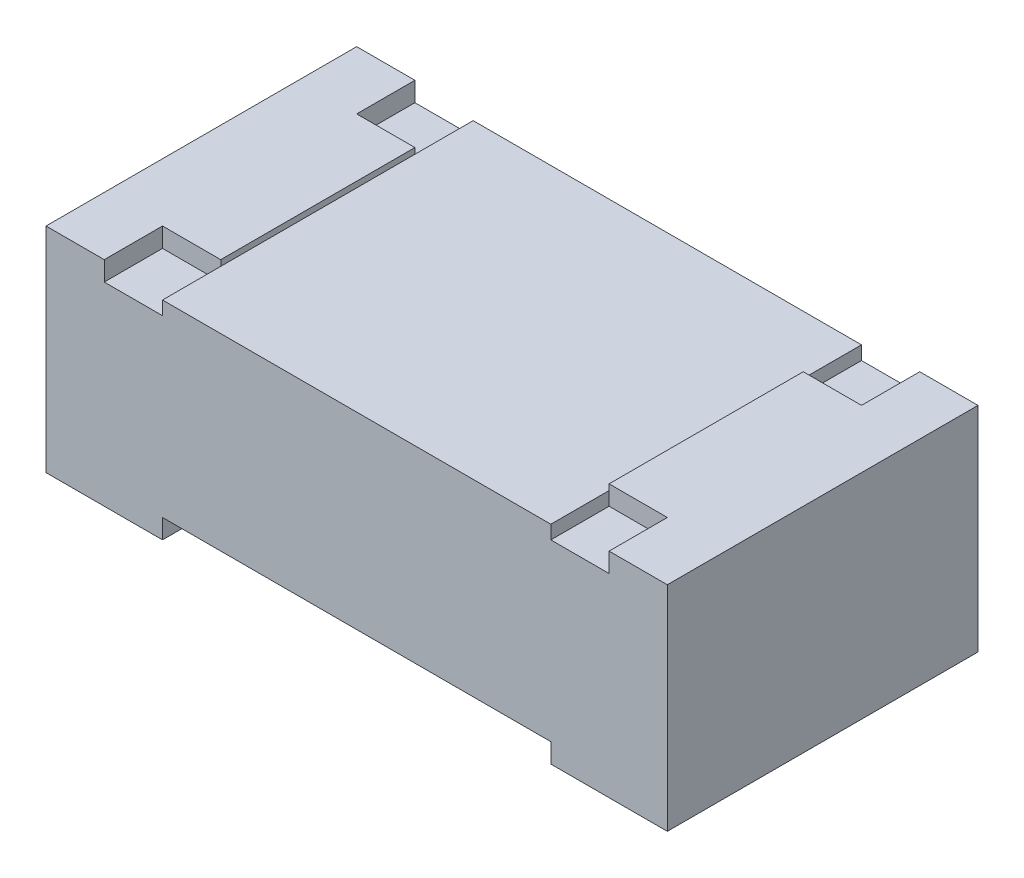
ISO-10303-21;
HEADER;
FILE_DESCRIPTION(('STEP AP214'),'2;1');
FILE_NAME('part.step','',(''),(''),'','','');
FILE_SCHEMA(('AUTOMOTIVE_DESIGN { 1 0 10303 214 1 1 1 1 }'));
ENDSEC;
DATA;
#1=APPLICATION_CONTEXT('core data for automotive mechanical design processes');
#2=APPLICATION_PROTOCOL_DEFINITION('international standard','automotive_design',2000,#1);
#3=PRODUCT_CONTEXT('',#1,'mechanical');
#4=PRODUCT('Part','Part','',(#3));
#5=PRODUCT_RELATED_PRODUCT_CATEGORY('part','',(#4));
#6=PRODUCT_DEFINITION_FORMATION('','',#4);
#7=PRODUCT_DEFINITION_CONTEXT('part definition',#1,'design');
#8=PRODUCT_DEFINITION('design','',#6,#7);
#9=PRODUCT_DEFINITION_SHAPE('','',#8);
#10=(LENGTH_UNIT() NAMED_UNIT(*) SI_UNIT(.MILLI.,.METRE.));
#11=(NAMED_UNIT(*) PLANE_ANGLE_UNIT() SI_UNIT($,.RADIAN.));
#12=(NAMED_UNIT(*) SI_UNIT($,.STERADIAN.) SOLID_ANGLE_UNIT());
#13=UNCERTAINTY_MEASURE_WITH_UNIT(LENGTH_MEASURE(1.E-05),#10,'distance_accuracy_value','');
#14=(GEOMETRIC_REPRESENTATION_CONTEXT(3) GLOBAL_UNCERTAINTY_ASSIGNED_CONTEXT((#13)) GLOBAL_UNIT_ASSIGNED_CONTEXT((#10,
#11,#12)) REPRESENTATION_CONTEXT('',''));
#15=CARTESIAN_POINT('',(0.,0.,0.));
#16=DIRECTION('',(0.,0.,1.));
#17=DIRECTION('',(1.,0.,0.));
#18=AXIS2_PLACEMENT_3D('',#15,#16,#17);
#19=CARTESIAN_POINT('',(12.8649999999998,1.58166,-40.4050019669691));
#20=DIRECTION('',(0.,-1.,0.));
#21=DIRECTION('',(1.,0.,0.));
#22=AXIS2_PLACEMENT_3D('',#19,#20,#21);
#23=PLANE('',#22);
#24=DIRECTION('',(0.,0.,1.));
#25=VECTOR('',#24,1.);
#26=CARTESIAN_POINT('',(12.5649999999998,1.58166,-40.4050019669691));
#27=LINE('',#26,#25);
#28=CARTESIAN_POINT('',(12.5649999999998,1.58166,-40.4050019669691));
#29=VERTEX_POINT('',#28);
#30=CARTESIAN_POINT('',(12.5649999999998,1.58166,-39.6050019669691));
#31=VERTEX_POINT('',#30);
#32=EDGE_CURVE('E19',#29,#31,#27,.T.);
#33=ORIENTED_EDGE('',*,*,#32,.F.);
#34=DIRECTION('',(-1.,0.,0.));
#35=VECTOR('',#34,1.);
#36=CARTESIAN_POINT('',(12.5649999999998,1.58166,-40.4050019669691));
#37=LINE('',#36,#35);
#38=CARTESIAN_POINT('',(12.8649999999998,1.58166,-40.4050019669691));
#39=VERTEX_POINT('',#38);
#40=EDGE_CURVE('E295',#39,#29,#37,.T.);
#41=ORIENTED_EDGE('',*,*,#40,.F.);
#42=DIRECTION('',(0.,0.,-1.));
#43=VECTOR('',#42,1.);
#44=CARTESIAN_POINT('',(12.8649999999998,1.58166,-40.4050019669691));
#45=LINE('',#44,#43);
#46=CARTESIAN_POINT('',(12.8649999999998,1.58166,-39.6050019669691));
#47=VERTEX_POINT('',#46);
#48=EDGE_CURVE('E305',#47,#39,#45,.T.);
#49=ORIENTED_EDGE('',*,*,#48,.F.);
#50=DIRECTION('',(-1.,0.,0.));
#51=VECTOR('',#50,1.);
#52=CARTESIAN_POINT('',(12.5649999999998,1.58166,-39.6050019669691));
#53=LINE('',#52,#51);
#54=EDGE_CURVE('E231',#47,#31,#53,.T.);
#55=ORIENTED_EDGE('',*,*,#54,.T.);
#56=EDGE_LOOP('',(#33,#41,#49,#55));
#57=FACE_BOUND('',#56,.T.);
#58=ADVANCED_FACE('F16',(#57),#23,.T.);
#59=CARTESIAN_POINT('',(12.5649999999998,1.58166,-40.4050019669691));
#60=DIRECTION('',(-1.,0.,0.));
#61=DIRECTION('',(0.,0.,1.));
#62=AXIS2_PLACEMENT_3D('',#59,#60,#61);
#63=PLANE('',#62);
#64=DIRECTION('',(0.,0.,1.));
#65=VECTOR('',#64,1.);
#66=CARTESIAN_POINT('',(12.5649999999998,1.63166,-40.4050019669691));
#67=LINE('',#66,#65);
#68=CARTESIAN_POINT('',(12.5649999999998,1.63166,-40.4050019669691));
#69=VERTEX_POINT('',#68);
#70=CARTESIAN_POINT('',(12.5649999999998,1.63166,-39.6050019669691));
#71=VERTEX_POINT('',#70);
#72=EDGE_CURVE('E247',#69,#71,#67,.T.);
#73=ORIENTED_EDGE('',*,*,#72,.F.);
#74=DIRECTION('',(0.,1.,0.));
#75=VECTOR('',#74,1.);
#76=CARTESIAN_POINT('',(12.5649999999998,1.58166,-40.4050019669691));
#77=LINE('',#76,#75);
#78=EDGE_CURVE('E226',#29,#69,#77,.T.);
#79=ORIENTED_EDGE('',*,*,#78,.F.);
#80=ORIENTED_EDGE('',*,*,#32,.T.);
#81=DIRECTION('',(0.,1.,0.));
#82=VECTOR('',#81,1.);
#83=CARTESIAN_POINT('',(12.5649999999998,1.58166,-39.6050019669691));
#84=LINE('',#83,#82);
#85=EDGE_CURVE('E223',#31,#71,#84,.T.);
#86=ORIENTED_EDGE('',*,*,#85,.T.);
#87=EDGE_LOOP('',(#73,#79,#80,#86));
#88=FACE_BOUND('',#87,.T.);
#89=ADVANCED_FACE('F222',(#88),#63,.T.);
#90=CARTESIAN_POINT('',(11.2649999999998,1.58166,-40.4050019669691));
#91=DIRECTION('',(0.,-1.,0.));
#92=DIRECTION('',(1.,0.,0.));
#93=AXIS2_PLACEMENT_3D('',#90,#91,#92);
#94=PLANE('',#93);
#95=DIRECTION('',(0.,0.,1.));
#96=VECTOR('',#95,1.);
#97=CARTESIAN_POINT('',(11.2649999999998,1.58166,-40.4050019669691));
#98=LINE('',#97,#96);
#99=CARTESIAN_POINT('',(11.2649999999998,1.58166,-40.4050019669691));
#100=VERTEX_POINT('',#99);
#101=CARTESIAN_POINT('',(11.2649999999998,1.58166,-39.6050019669691));
#102=VERTEX_POINT('',#101);
#103=EDGE_CURVE('E192',#100,#102,#98,.T.);
#104=ORIENTED_EDGE('',*,*,#103,.F.);
#105=DIRECTION('',(1.,0.,0.));
#106=VECTOR('',#105,1.);
#107=CARTESIAN_POINT('',(11.5649999999998,1.58166,-40.4050019669691));
#108=LINE('',#107,#106);
#109=CARTESIAN_POINT('',(11.5649999999998,1.58166,-40.4050019669691));
#110=VERTEX_POINT('',#109);
#111=EDGE_CURVE('E291',#100,#110,#108,.T.);
#112=ORIENTED_EDGE('',*,*,#111,.T.);
#113=DIRECTION('',(0.,0.,-1.));
#114=VECTOR('',#113,1.);
#115=CARTESIAN_POINT('',(11.5649999999998,1.58166,-40.4050019669691));
#116=LINE('',#115,#114);
#117=CARTESIAN_POINT('',(11.5649999999998,1.58166,-39.6050019669691));
#118=VERTEX_POINT('',#117);
#119=EDGE_CURVE('E187',#118,#110,#116,.T.);
#120=ORIENTED_EDGE('',*,*,#119,.F.);
#121=DIRECTION('',(1.,0.,0.));
#122=VECTOR('',#121,1.);
#123=CARTESIAN_POINT('',(11.5649999999998,1.58166,-39.6050019669691));
#124=LINE('',#123,#122);
#125=EDGE_CURVE('E203',#102,#118,#124,.T.);
#126=ORIENTED_EDGE('',*,*,#125,.F.);
#127=EDGE_LOOP('',(#104,#112,#120,#126));
#128=FACE_BOUND('',#127,.T.);
#129=ADVANCED_FACE('F204',(#128),#94,.T.);
#130=CARTESIAN_POINT('',(11.5649999999998,1.58166,-40.4050019669691));
#131=DIRECTION('',(1.,0.,0.));
#132=DIRECTION('',(0.,0.,-1.));
#133=AXIS2_PLACEMENT_3D('',#130,#131,#132);
#134=PLANE('',#133);
#135=ORIENTED_EDGE('',*,*,#119,.T.);
#136=DIRECTION('',(0.,1.,0.));
#137=VECTOR('',#136,1.);
#138=CARTESIAN_POINT('',(11.5649999999998,2.08166,-40.4050019669691));
#139=LINE('',#138,#137);
#140=CARTESIAN_POINT('',(11.5649999999998,1.63166,-40.4050019669691));
#141=VERTEX_POINT('',#140);
#142=EDGE_CURVE('E289',#110,#141,#139,.T.);
#143=ORIENTED_EDGE('',*,*,#142,.T.);
#144=DIRECTION('',(0.,0.,1.));
#145=VECTOR('',#144,1.);
#146=CARTESIAN_POINT('',(11.5649999999998,1.63166,-40.4050019669691));
#147=LINE('',#146,#145);
#148=CARTESIAN_POINT('',(11.5649999999998,1.63166,-39.6050019669691));
#149=VERTEX_POINT('',#148);
#150=EDGE_CURVE('E245',#149,#141,#147,.F.);
#151=ORIENTED_EDGE('',*,*,#150,.F.);
#152=DIRECTION('',(0.,1.,0.));
#153=VECTOR('',#152,1.);
#154=CARTESIAN_POINT('',(11.5649999999998,2.08166,-39.6050019669691));
#155=LINE('',#154,#153);
#156=EDGE_CURVE('E207',#118,#149,#155,.T.);
#157=ORIENTED_EDGE('',*,*,#156,.F.);
#158=EDGE_LOOP('',(#135,#143,#151,#157));
#159=FACE_BOUND('',#158,.T.);
#160=ADVANCED_FACE('F489',(#159),#134,.T.);
#161=CARTESIAN_POINT('',(11.4149999999998,2.08166,-40.4050019669691));
#162=DIRECTION('',(-1.,0.,0.));
#163=DIRECTION('',(0.,0.,1.));
#164=AXIS2_PLACEMENT_3D('',#161,#162,#163);
#165=PLANE('',#164);
#166=DIRECTION('',(0.,1.,0.));
#167=VECTOR('',#166,1.);
#168=CARTESIAN_POINT('',(11.4149999999998,2.08166,-40.2550019669691));
#169=LINE('',#168,#167);
#170=CARTESIAN_POINT('',(11.4149999999998,2.13166,-40.2550019669691));
#171=VERTEX_POINT('',#170);
#172=CARTESIAN_POINT('',(11.4149999999998,2.08166,-40.2550019669691));
#173=VERTEX_POINT('',#172);
#174=EDGE_CURVE('E282',#171,#173,#169,.F.);
#175=ORIENTED_EDGE('',*,*,#174,.T.);
#176=DIRECTION('',(0.,0.,1.));
#177=VECTOR('',#176,1.);
#178=CARTESIAN_POINT('',(11.4149999999998,2.08166,-40.4050019669691));
#179=LINE('',#178,#177);
#180=CARTESIAN_POINT('',(11.4149999999998,2.08166,-40.4050019669691));
#181=VERTEX_POINT('',#180);
#182=EDGE_CURVE('E284',#181,#173,#179,.T.);
#183=ORIENTED_EDGE('',*,*,#182,.F.);
#184=DIRECTION('',(0.,1.,0.));
#185=VECTOR('',#184,1.);
#186=CARTESIAN_POINT('',(11.4149999999998,2.08166,-40.4050019669691));
#187=LINE('',#186,#185);
#188=CARTESIAN_POINT('',(11.4149999999998,2.13166,-40.4050019669691));
#189=VERTEX_POINT('',#188);
#190=EDGE_CURVE('E287',#181,#189,#187,.T.);
#191=ORIENTED_EDGE('',*,*,#190,.T.);
#192=DIRECTION('',(0.,0.,1.));
#193=VECTOR('',#192,1.);
#194=CARTESIAN_POINT('',(11.4149999999998,2.13166,-40.4050019669691));
#195=LINE('',#194,#193);
#196=EDGE_CURVE('E274',#171,#189,#195,.F.);
#197=ORIENTED_EDGE('',*,*,#196,.F.);
#198=EDGE_LOOP('',(#175,#183,#191,#197));
#199=FACE_BOUND('',#198,.T.);
#200=ADVANCED_FACE('F491',(#199),#165,.F.);
#201=CARTESIAN_POINT('',(11.2649999999998,2.13166,-40.4050019669691));
#202=DIRECTION('',(-1.,0.,0.));
#203=DIRECTION('',(0.,0.,1.));
#204=AXIS2_PLACEMENT_3D('',#201,#202,#203);
#205=PLANE('',#204);
#206=DIRECTION('',(0.,0.,1.));
#207=VECTOR('',#206,1.);
#208=CARTESIAN_POINT('',(11.2649999999998,2.13166,-40.4050019669691));
#209=LINE('',#208,#207);
#210=CARTESIAN_POINT('',(11.2649999999998,2.13166,-40.4050019669691));
#211=VERTEX_POINT('',#210);
#212=CARTESIAN_POINT('',(11.2649999999998,2.13166,-39.6050019669691));
#213=VERTEX_POINT('',#212);
#214=EDGE_CURVE('E269',#211,#213,#209,.T.);
#215=ORIENTED_EDGE('',*,*,#214,.F.);
#216=DIRECTION('',(0.,1.,0.));
#217=VECTOR('',#216,1.);
#218=CARTESIAN_POINT('',(11.2649999999998,2.08166,-40.4050019669691));
#219=LINE('',#218,#217);
#220=EDGE_CURVE('E198',#211,#100,#219,.F.);
#221=ORIENTED_EDGE('',*,*,#220,.T.);
#222=ORIENTED_EDGE('',*,*,#103,.T.);
#223=DIRECTION('',(0.,1.,0.));
#224=VECTOR('',#223,1.);
#225=CARTESIAN_POINT('',(11.2649999999998,2.08166,-39.6050019669691));
#226=LINE('',#225,#224);
#227=EDGE_CURVE('E196',#213,#102,#226,.F.);
#228=ORIENTED_EDGE('',*,*,#227,.F.);
#229=EDGE_LOOP('',(#215,#221,#222,#228));
#230=FACE_BOUND('',#229,.T.);
#231=ADVANCED_FACE('F194',(#230),#205,.T.);
#232=CARTESIAN_POINT('',(11.4149999999998,2.08166,-39.6050019669691));
#233=DIRECTION('',(-1.,0.,0.));
#234=DIRECTION('',(0.,0.,1.));
#235=AXIS2_PLACEMENT_3D('',#232,#233,#234);
#236=PLANE('',#235);
#237=DIRECTION('',(0.,1.,0.));
#238=VECTOR('',#237,1.);
#239=CARTESIAN_POINT('',(11.4149999999998,2.08166,-39.6050019669691));
#240=LINE('',#239,#238);
#241=CARTESIAN_POINT('',(11.4149999999998,2.08166,-39.6050019669691));
#242=VERTEX_POINT('',#241);
#243=CARTESIAN_POINT('',(11.4149999999998,2.13166,-39.6050019669691));
#244=VERTEX_POINT('',#243);
#245=EDGE_CURVE('E200',#242,#244,#240,.T.);
#246=ORIENTED_EDGE('',*,*,#245,.F.);
#247=DIRECTION('',(0.,0.,1.));
#248=VECTOR('',#247,1.);
#249=CARTESIAN_POINT('',(11.4149999999998,2.08166,-40.4050019669691));
#250=LINE('',#249,#248);
#251=CARTESIAN_POINT('',(11.4149999999998,2.08166,-39.7550019669691));
#252=VERTEX_POINT('',#251);
#253=EDGE_CURVE('E249',#252,#242,#250,.T.);
#254=ORIENTED_EDGE('',*,*,#253,.F.);
#255=DIRECTION('',(0.,1.,0.));
#256=VECTOR('',#255,1.);
#257=CARTESIAN_POINT('',(11.4149999999998,2.08166,-39.7550019669691));
#258=LINE('',#257,#256);
#259=CARTESIAN_POINT('',(11.4149999999998,2.13166,-39.7550019669691));
#260=VERTEX_POINT('',#259);
#261=EDGE_CURVE('E263',#252,#260,#258,.T.);
#262=ORIENTED_EDGE('',*,*,#261,.T.);
#263=DIRECTION('',(0.,0.,1.));
#264=VECTOR('',#263,1.);
#265=CARTESIAN_POINT('',(11.4149999999998,2.13166,-40.4050019669691));
#266=LINE('',#265,#264);
#267=EDGE_CURVE('E265',#244,#260,#266,.F.);
#268=ORIENTED_EDGE('',*,*,#267,.F.);
#269=EDGE_LOOP('',(#246,#254,#262,#268));
#270=FACE_BOUND('',#269,.T.);
#271=ADVANCED_FACE('F483',(#270),#236,.F.);
#272=CARTESIAN_POINT('',(12.7149999999998,2.08166,-39.6050019669691));
#273=DIRECTION('',(1.,0.,0.));
#274=DIRECTION('',(0.,0.,-1.));
#275=AXIS2_PLACEMENT_3D('',#272,#273,#274);
#276=PLANE('',#275);
#277=DIRECTION('',(0.,1.,0.));
#278=VECTOR('',#277,1.);
#279=CARTESIAN_POINT('',(12.7149999999998,2.08166,-39.7550019669691));
#280=LINE('',#279,#278);
#281=CARTESIAN_POINT('',(12.7149999999998,2.13166,-39.7550019669691));
#282=VERTEX_POINT('',#281);
#283=CARTESIAN_POINT('',(12.7149999999998,2.08166,-39.7550019669691));
#284=VERTEX_POINT('',#283);
#285=EDGE_CURVE('E335',#282,#284,#280,.F.);
#286=ORIENTED_EDGE('',*,*,#285,.T.);
#287=DIRECTION('',(0.,0.,1.));
#288=VECTOR('',#287,1.);
#289=CARTESIAN_POINT('',(12.7149999999998,2.08166,-40.4050019669691));
#290=LINE('',#289,#288);
#291=CARTESIAN_POINT('',(12.7149999999998,2.08166,-39.6050019669691));
#292=VERTEX_POINT('',#291);
#293=EDGE_CURVE('E252',#292,#284,#290,.F.);
#294=ORIENTED_EDGE('',*,*,#293,.F.);
#295=DIRECTION('',(0.,1.,0.));
#296=VECTOR('',#295,1.);
#297=CARTESIAN_POINT('',(12.7149999999998,1.58166,-39.6050019669691));
#298=LINE('',#297,#296);
#299=CARTESIAN_POINT('',(12.7149999999998,2.13166,-39.6050019669691));
#300=VERTEX_POINT('',#299);
#301=EDGE_CURVE('E235',#292,#300,#298,.T.);
#302=ORIENTED_EDGE('',*,*,#301,.T.);
#303=DIRECTION('',(0.,0.,1.));
#304=VECTOR('',#303,1.);
#305=CARTESIAN_POINT('',(12.7149999999998,2.13166,-40.4050019669691));
#306=LINE('',#305,#304);
#307=EDGE_CURVE('E318',#282,#300,#306,.T.);
#308=ORIENTED_EDGE('',*,*,#307,.F.);
#309=EDGE_LOOP('',(#286,#294,#302,#308));
#310=FACE_BOUND('',#309,.T.);
#311=ADVANCED_FACE('F553',(#310),#276,.F.);
#312=CARTESIAN_POINT('',(12.8649999999998,2.13166,-40.4050019669691));
#313=DIRECTION('',(1.,0.,0.));
#314=DIRECTION('',(0.,0.,-1.));
#315=AXIS2_PLACEMENT_3D('',#312,#313,#314);
#316=PLANE('',#315);
#317=ORIENTED_EDGE('',*,*,#48,.T.);
#318=DIRECTION('',(0.,1.,0.));
#319=VECTOR('',#318,1.);
#320=CARTESIAN_POINT('',(12.8649999999998,1.58166,-40.4050019669691));
#321=LINE('',#320,#319);
#322=CARTESIAN_POINT('',(12.8649999999998,2.13166,-40.4050019669691));
#323=VERTEX_POINT('',#322);
#324=EDGE_CURVE('E297',#323,#39,#321,.F.);
#325=ORIENTED_EDGE('',*,*,#324,.F.);
#326=DIRECTION('',(0.,0.,1.));
#327=VECTOR('',#326,1.);
#328=CARTESIAN_POINT('',(12.8649999999998,2.13166,-40.4050019669691));
#329=LINE('',#328,#327);
#330=CARTESIAN_POINT('',(12.8649999999998,2.13166,-39.6050019669691));
#331=VERTEX_POINT('',#330);
#332=EDGE_CURVE('E311',#331,#323,#329,.F.);
#333=ORIENTED_EDGE('',*,*,#332,.F.);
#334=DIRECTION('',(0.,1.,0.));
#335=VECTOR('',#334,1.);
#336=CARTESIAN_POINT('',(12.8649999999998,2.13166,-39.6050019669691));
#337=LINE('',#336,#335);
#338=EDGE_CURVE('E237',#331,#47,#337,.F.);
#339=ORIENTED_EDGE('',*,*,#338,.T.);
#340=EDGE_LOOP('',(#317,#325,#333,#339));
#341=FACE_BOUND('',#340,.T.);
#342=ADVANCED_FACE('F309',(#341),#316,.T.);
#343=CARTESIAN_POINT('',(12.7149999999998,2.08166,-40.4050019669691));
#344=DIRECTION('',(1.,0.,0.));
#345=DIRECTION('',(0.,0.,-1.));
#346=AXIS2_PLACEMENT_3D('',#343,#344,#345);
#347=PLANE('',#346);
#348=DIRECTION('',(0.,1.,0.));
#349=VECTOR('',#348,1.);
#350=CARTESIAN_POINT('',(12.7149999999998,1.58166,-40.4050019669691));
#351=LINE('',#350,#349);
#352=CARTESIAN_POINT('',(12.7149999999998,2.08166,-40.4050019669691));
#353=VERTEX_POINT('',#352);
#354=CARTESIAN_POINT('',(12.7149999999998,2.13166,-40.4050019669691));
#355=VERTEX_POINT('',#354);
#356=EDGE_CURVE('E300',#353,#355,#351,.T.);
#357=ORIENTED_EDGE('',*,*,#356,.F.);
#358=DIRECTION('',(0.,0.,1.));
#359=VECTOR('',#358,1.);
#360=CARTESIAN_POINT('',(12.7149999999998,2.08166,-40.4050019669691));
#361=LINE('',#360,#359);
#362=CARTESIAN_POINT('',(12.7149999999998,2.08166,-40.2550019669691));
#363=VERTEX_POINT('',#362);
#364=EDGE_CURVE('E400',#363,#353,#361,.F.);
#365=ORIENTED_EDGE('',*,*,#364,.F.);
#366=DIRECTION('',(0.,1.,0.));
#367=VECTOR('',#366,1.);
#368=CARTESIAN_POINT('',(12.7149999999998,2.08166,-40.2550019669691));
#369=LINE('',#368,#367);
#370=CARTESIAN_POINT('',(12.7149999999998,2.13166,-40.2550019669691));
#371=VERTEX_POINT('',#370);
#372=EDGE_CURVE('E405',#363,#371,#369,.T.);
#373=ORIENTED_EDGE('',*,*,#372,.T.);
#374=DIRECTION('',(0.,0.,1.));
#375=VECTOR('',#374,1.);
#376=CARTESIAN_POINT('',(12.7149999999998,2.13166,-40.4050019669691));
#377=LINE('',#376,#375);
#378=EDGE_CURVE('E327',#355,#371,#377,.T.);
#379=ORIENTED_EDGE('',*,*,#378,.F.);
#380=EDGE_LOOP('',(#357,#365,#373,#379));
#381=FACE_BOUND('',#380,.T.);
#382=ADVANCED_FACE('F415',(#381),#347,.F.);
#383=CARTESIAN_POINT('',(11.3149999999998,1.63166,-40.4050019669691));
#384=DIRECTION('',(0.,-1.,0.));
#385=DIRECTION('',(1.,0.,0.));
#386=AXIS2_PLACEMENT_3D('',#383,#384,#385);
#387=PLANE('',#386);
#388=ORIENTED_EDGE('',*,*,#150,.T.);
#389=DIRECTION('',(1.,0.,0.));
#390=VECTOR('',#389,1.);
#391=CARTESIAN_POINT('',(11.3149999999998,1.63166,-40.4050019669691));
#392=LINE('',#391,#390);
#393=EDGE_CURVE('E395',#141,#69,#392,.T.);
#394=ORIENTED_EDGE('',*,*,#393,.T.);
#395=ORIENTED_EDGE('',*,*,#72,.T.);
#396=DIRECTION('',(1.,0.,0.));
#397=VECTOR('',#396,1.);
#398=CARTESIAN_POINT('',(11.3149999999998,1.63166,-39.6050019669691));
#399=LINE('',#398,#397);
#400=EDGE_CURVE('E234',#149,#71,#399,.T.);
#401=ORIENTED_EDGE('',*,*,#400,.F.);
#402=EDGE_LOOP('',(#388,#394,#395,#401));
#403=FACE_BOUND('',#402,.T.);
#404=ADVANCED_FACE('F243',(#403),#387,.T.);
#405=CARTESIAN_POINT('',(11.3149999999998,2.08166,-40.4050019669691));
#406=DIRECTION('',(0.,1.,0.));
#407=DIRECTION('',(-1.,0.,0.));
#408=AXIS2_PLACEMENT_3D('',#405,#406,#407);
#409=PLANE('',#408);
#410=DIRECTION('',(1.,0.,0.));
#411=VECTOR('',#410,1.);
#412=CARTESIAN_POINT('',(11.3149999999998,2.08166,-40.4050019669691));
#413=LINE('',#412,#411);
#414=CARTESIAN_POINT('',(11.5649999999998,2.08166,-40.4050019669691));
#415=VERTEX_POINT('',#414);
#416=EDGE_CURVE('E390',#415,#181,#413,.F.);
#417=ORIENTED_EDGE('',*,*,#416,.T.);
#418=ORIENTED_EDGE('',*,*,#182,.T.);
#419=DIRECTION('',(1.,0.,0.));
#420=VECTOR('',#419,1.);
#421=CARTESIAN_POINT('',(11.4149999999998,2.08166,-40.2550019669691));
#422=LINE('',#421,#420);
#423=CARTESIAN_POINT('',(11.5649999999998,2.08166,-40.2550019669691));
#424=VERTEX_POINT('',#423);
#425=EDGE_CURVE('E280',#173,#424,#422,.T.);
#426=ORIENTED_EDGE('',*,*,#425,.T.);
#427=DIRECTION('',(0.,0.,1.));
#428=VECTOR('',#427,1.);
#429=CARTESIAN_POINT('',(11.5649999999998,2.08166,-40.4050019669691));
#430=LINE('',#429,#428);
#431=EDGE_CURVE('E384',#415,#424,#430,.T.);
#432=ORIENTED_EDGE('',*,*,#431,.F.);
#433=EDGE_LOOP('',(#417,#418,#426,#432));
#434=FACE_BOUND('',#433,.T.);
#435=ADVANCED_FACE('F543',(#434),#409,.T.);
#436=CARTESIAN_POINT('',(11.4149999999998,2.08166,-40.2550019669691));
#437=DIRECTION('',(0.,0.,1.));
#438=DIRECTION('',(1.,0.,0.));
#439=AXIS2_PLACEMENT_3D('',#436,#437,#438);
#440=PLANE('',#439);
#441=DIRECTION('',(0.,1.,0.));
#442=VECTOR('',#441,1.);
#443=CARTESIAN_POINT('',(11.5649999999998,2.11666,-40.2550019669691));
#444=LINE('',#443,#442);
#445=CARTESIAN_POINT('',(11.5649999999998,2.11666,-40.2550019669691));
#446=VERTEX_POINT('',#445);
#447=EDGE_CURVE('E387',#424,#446,#444,.T.);
#448=ORIENTED_EDGE('',*,*,#447,.F.);
#449=ORIENTED_EDGE('',*,*,#425,.F.);
#450=ORIENTED_EDGE('',*,*,#174,.F.);
#451=DIRECTION('',(-1.,0.,0.));
#452=VECTOR('',#451,1.);
#453=CARTESIAN_POINT('',(11.5649999999998,2.13166,-40.2550019669691));
#454=LINE('',#453,#452);
#455=CARTESIAN_POINT('',(11.5649999999998,2.13166,-40.2550019669691));
#456=VERTEX_POINT('',#455);
#457=EDGE_CURVE('E277',#456,#171,#454,.T.);
#458=ORIENTED_EDGE('',*,*,#457,.F.);
#459=DIRECTION('',(0.,1.,0.));
#460=VECTOR('',#459,1.);
#461=CARTESIAN_POINT('',(11.5649999999998,2.13166,-40.2550019669691));
#462=LINE('',#461,#460);
#463=EDGE_CURVE('E381',#446,#456,#462,.T.);
#464=ORIENTED_EDGE('',*,*,#463,.F.);
#465=EDGE_LOOP('',(#448,#449,#450,#458,#464));
#466=FACE_BOUND('',#465,.T.);
#467=ADVANCED_FACE('F540',(#466),#440,.F.);
#468=CARTESIAN_POINT('',(11.5649999999998,2.13166,-40.4050019669691));
#469=DIRECTION('',(0.,1.,0.));
#470=DIRECTION('',(-1.,0.,0.));
#471=AXIS2_PLACEMENT_3D('',#468,#469,#470);
#472=PLANE('',#471);
#473=DIRECTION('',(-1.,0.,0.));
#474=VECTOR('',#473,1.);
#475=CARTESIAN_POINT('',(11.4149999999998,2.13166,-39.7550019669691));
#476=LINE('',#475,#474);
#477=CARTESIAN_POINT('',(11.5649999999998,2.13166,-39.7550019669691));
#478=VERTEX_POINT('',#477);
#479=EDGE_CURVE('E261',#260,#478,#476,.F.);
#480=ORIENTED_EDGE('',*,*,#479,.T.);
#481=DIRECTION('',(0.,0.,-1.));
#482=VECTOR('',#481,1.);
#483=CARTESIAN_POINT('',(11.5649999999998,2.13166,-40.4050019669691));
#484=LINE('',#483,#482);
#485=EDGE_CURVE('E378',#456,#478,#484,.F.);
#486=ORIENTED_EDGE('',*,*,#485,.F.);
#487=ORIENTED_EDGE('',*,*,#457,.T.);
#488=ORIENTED_EDGE('',*,*,#196,.T.);
#489=DIRECTION('',(-1.,0.,0.));
#490=VECTOR('',#489,1.);
#491=CARTESIAN_POINT('',(11.5649999999998,2.13166,-40.4050019669691));
#492=LINE('',#491,#490);
#493=EDGE_CURVE('E271',#189,#211,#492,.T.);
#494=ORIENTED_EDGE('',*,*,#493,.T.);
#495=ORIENTED_EDGE('',*,*,#214,.T.);
#496=DIRECTION('',(-1.,0.,0.));
#497=VECTOR('',#496,1.);
#498=CARTESIAN_POINT('',(11.5649999999998,2.13166,-39.6050019669691));
#499=LINE('',#498,#497);
#500=EDGE_CURVE('E211',#213,#244,#499,.F.);
#501=ORIENTED_EDGE('',*,*,#500,.T.);
#502=ORIENTED_EDGE('',*,*,#267,.T.);
#503=EDGE_LOOP('',(#480,#486,#487,#488,#494,#495,#501,#502));
#504=FACE_BOUND('',#503,.T.);
#505=ADVANCED_FACE('F486',(#504),#472,.T.);
#506=CARTESIAN_POINT('',(11.4149999999998,2.08166,-39.7550019669691));
#507=DIRECTION('',(0.,0.,-1.));
#508=DIRECTION('',(-1.,0.,0.));
#509=AXIS2_PLACEMENT_3D('',#506,#507,#508);
#510=PLANE('',#509);
#511=DIRECTION('',(0.,1.,0.));
#512=VECTOR('',#511,1.);
#513=CARTESIAN_POINT('',(11.5649999999998,2.13166,-39.7550019669691));
#514=LINE('',#513,#512);
#515=CARTESIAN_POINT('',(11.5649999999998,2.11666,-39.7550019669691));
#516=VERTEX_POINT('',#515);
#517=EDGE_CURVE('E375',#478,#516,#514,.F.);
#518=ORIENTED_EDGE('',*,*,#517,.F.);
#519=ORIENTED_EDGE('',*,*,#479,.F.);
#520=ORIENTED_EDGE('',*,*,#261,.F.);
#521=DIRECTION('',(-1.,0.,0.));
#522=VECTOR('',#521,1.);
#523=CARTESIAN_POINT('',(11.3149999999998,2.08166,-39.7550019669691));
#524=LINE('',#523,#522);
#525=CARTESIAN_POINT('',(11.5649999999998,2.08166,-39.7550019669691));
#526=VERTEX_POINT('',#525);
#527=EDGE_CURVE('E255',#526,#252,#524,.T.);
#528=ORIENTED_EDGE('',*,*,#527,.F.);
#529=DIRECTION('',(0.,1.,0.));
#530=VECTOR('',#529,1.);
#531=CARTESIAN_POINT('',(11.5649999999998,2.11666,-39.7550019669691));
#532=LINE('',#531,#530);
#533=EDGE_CURVE('E372',#516,#526,#532,.F.);
#534=ORIENTED_EDGE('',*,*,#533,.F.);
#535=EDGE_LOOP('',(#518,#519,#520,#528,#534));
#536=FACE_BOUND('',#535,.T.);
#537=ADVANCED_FACE('F534',(#536),#510,.F.);
#538=CARTESIAN_POINT('',(11.3149999999998,2.08166,-40.4050019669691));
#539=DIRECTION('',(0.,1.,0.));
#540=DIRECTION('',(-1.,0.,0.));
#541=AXIS2_PLACEMENT_3D('',#538,#539,#540);
#542=PLANE('',#541);
#543=DIRECTION('',(1.,0.,0.));
#544=VECTOR('',#543,1.);
#545=CARTESIAN_POINT('',(11.3149999999998,2.08166,-39.6050019669691));
#546=LINE('',#545,#544);
#547=CARTESIAN_POINT('',(11.5649999999998,2.08166,-39.6050019669691));
#548=VERTEX_POINT('',#547);
#549=EDGE_CURVE('E248',#548,#242,#546,.F.);
#550=ORIENTED_EDGE('',*,*,#549,.F.);
#551=DIRECTION('',(0.,0.,1.));
#552=VECTOR('',#551,1.);
#553=CARTESIAN_POINT('',(11.5649999999998,2.08166,-40.4050019669691));
#554=LINE('',#553,#552);
#555=EDGE_CURVE('E369',#526,#548,#554,.T.);
#556=ORIENTED_EDGE('',*,*,#555,.F.);
#557=ORIENTED_EDGE('',*,*,#527,.T.);
#558=ORIENTED_EDGE('',*,*,#253,.T.);
#559=EDGE_LOOP('',(#550,#556,#557,#558));
#560=FACE_BOUND('',#559,.T.);
#561=ADVANCED_FACE('F480',(#560),#542,.T.);
#562=CARTESIAN_POINT('',(11.3149999999998,2.08166,-40.4050019669691));
#563=DIRECTION('',(0.,1.,0.));
#564=DIRECTION('',(-1.,0.,0.));
#565=AXIS2_PLACEMENT_3D('',#562,#563,#564);
#566=PLANE('',#565);
#567=DIRECTION('',(0.,0.,-1.));
#568=VECTOR('',#567,1.);
#569=CARTESIAN_POINT('',(12.5649999999998,2.08166,-40.4050019669691));
#570=LINE('',#569,#568);
#571=CARTESIAN_POINT('',(12.5649999999998,2.08166,-39.6050019669691));
#572=VERTEX_POINT('',#571);
#573=CARTESIAN_POINT('',(12.5649999999998,2.08166,-39.7550019669691));
#574=VERTEX_POINT('',#573);
#575=EDGE_CURVE('E359',#572,#574,#570,.T.);
#576=ORIENTED_EDGE('',*,*,#575,.F.);
#577=DIRECTION('',(-1.,0.,0.));
#578=VECTOR('',#577,1.);
#579=CARTESIAN_POINT('',(11.3149999999998,2.08166,-39.6050019669691));
#580=LINE('',#579,#578);
#581=EDGE_CURVE('E337',#572,#292,#580,.F.);
#582=ORIENTED_EDGE('',*,*,#581,.T.);
#583=ORIENTED_EDGE('',*,*,#293,.T.);
#584=DIRECTION('',(-1.,0.,0.));
#585=VECTOR('',#584,1.);
#586=CARTESIAN_POINT('',(11.4149999999998,2.08166,-39.7550019669691));
#587=LINE('',#586,#585);
#588=EDGE_CURVE('E333',#284,#574,#587,.T.);
#589=ORIENTED_EDGE('',*,*,#588,.T.);
#590=EDGE_LOOP('',(#576,#582,#583,#589));
#591=FACE_BOUND('',#590,.T.);
#592=ADVANCED_FACE('F343',(#591),#566,.T.);
#593=CARTESIAN_POINT('',(11.4149999999998,2.08166,-39.7550019669691));
#594=DIRECTION('',(0.,0.,-1.));
#595=DIRECTION('',(-1.,0.,0.));
#596=AXIS2_PLACEMENT_3D('',#593,#594,#595);
#597=PLANE('',#596);
#598=DIRECTION('',(0.,1.,0.));
#599=VECTOR('',#598,1.);
#600=CARTESIAN_POINT('',(12.5649999999998,2.11666,-39.7550019669691));
#601=LINE('',#600,#599);
#602=CARTESIAN_POINT('',(12.5649999999998,2.11666,-39.7550019669691));
#603=VERTEX_POINT('',#602);
#604=EDGE_CURVE('E348',#574,#603,#601,.T.);
#605=ORIENTED_EDGE('',*,*,#604,.F.);
#606=ORIENTED_EDGE('',*,*,#588,.F.);
#607=ORIENTED_EDGE('',*,*,#285,.F.);
#608=DIRECTION('',(-1.,0.,0.));
#609=VECTOR('',#608,1.);
#610=CARTESIAN_POINT('',(12.5649999999998,2.13166,-39.7550019669691));
#611=LINE('',#610,#609);
#612=CARTESIAN_POINT('',(12.5649999999998,2.13166,-39.7550019669691));
#613=VERTEX_POINT('',#612);
#614=EDGE_CURVE('E324',#613,#282,#611,.F.);
#615=ORIENTED_EDGE('',*,*,#614,.F.);
#616=DIRECTION('',(0.,1.,0.));
#617=VECTOR('',#616,1.);
#618=CARTESIAN_POINT('',(12.5649999999998,2.13166,-39.7550019669691));
#619=LINE('',#618,#617);
#620=EDGE_CURVE('E351',#603,#613,#619,.T.);
#621=ORIENTED_EDGE('',*,*,#620,.F.);
#622=EDGE_LOOP('',(#605,#606,#607,#615,#621));
#623=FACE_BOUND('',#622,.T.);
#624=ADVANCED_FACE('F346',(#623),#597,.F.);
#625=CARTESIAN_POINT('',(12.5649999999998,2.13166,-40.4050019669691));
#626=DIRECTION('',(0.,1.,0.));
#627=DIRECTION('',(-1.,0.,0.));
#628=AXIS2_PLACEMENT_3D('',#625,#626,#627);
#629=PLANE('',#628);
#630=ORIENTED_EDGE('',*,*,#332,.T.);
#631=DIRECTION('',(-1.,0.,0.));
#632=VECTOR('',#631,1.);
#633=CARTESIAN_POINT('',(12.5649999999998,2.13166,-40.4050019669691));
#634=LINE('',#633,#632);
#635=EDGE_CURVE('E407',#323,#355,#634,.T.);
#636=ORIENTED_EDGE('',*,*,#635,.T.);
#637=ORIENTED_EDGE('',*,*,#378,.T.);
#638=DIRECTION('',(1.,0.,0.));
#639=VECTOR('',#638,1.);
#640=CARTESIAN_POINT('',(11.4149999999998,2.13166,-40.2550019669691));
#641=LINE('',#640,#639);
#642=CARTESIAN_POINT('',(12.5649999999998,2.13166,-40.2550019669691));
#643=VERTEX_POINT('',#642);
#644=EDGE_CURVE('E403',#371,#643,#641,.F.);
#645=ORIENTED_EDGE('',*,*,#644,.T.);
#646=DIRECTION('',(0.,0.,1.));
#647=VECTOR('',#646,1.);
#648=CARTESIAN_POINT('',(12.5649999999998,2.13166,-40.4050019669691));
#649=LINE('',#648,#647);
#650=EDGE_CURVE('E362',#613,#643,#649,.F.);
#651=ORIENTED_EDGE('',*,*,#650,.F.);
#652=ORIENTED_EDGE('',*,*,#614,.T.);
#653=ORIENTED_EDGE('',*,*,#307,.T.);
#654=DIRECTION('',(-1.,0.,0.));
#655=VECTOR('',#654,1.);
#656=CARTESIAN_POINT('',(12.5649999999998,2.13166,-39.6050019669691));
#657=LINE('',#656,#655);
#658=EDGE_CURVE('E314',#300,#331,#657,.F.);
#659=ORIENTED_EDGE('',*,*,#658,.T.);
#660=EDGE_LOOP('',(#630,#636,#637,#645,#651,#652,#653,#659));
#661=FACE_BOUND('',#660,.T.);
#662=ADVANCED_FACE('F322',(#661),#629,.T.);
#663=CARTESIAN_POINT('',(11.4149999999998,2.08166,-40.2550019669691));
#664=DIRECTION('',(0.,0.,1.));
#665=DIRECTION('',(1.,0.,0.));
#666=AXIS2_PLACEMENT_3D('',#663,#664,#665);
#667=PLANE('',#666);
#668=DIRECTION('',(0.,1.,0.));
#669=VECTOR('',#668,1.);
#670=CARTESIAN_POINT('',(12.5649999999998,2.13166,-40.2550019669691));
#671=LINE('',#670,#669);
#672=CARTESIAN_POINT('',(12.5649999999998,2.11666,-40.2550019669691));
#673=VERTEX_POINT('',#672);
#674=EDGE_CURVE('E427',#643,#673,#671,.F.);
#675=ORIENTED_EDGE('',*,*,#674,.F.);
#676=ORIENTED_EDGE('',*,*,#644,.F.);
#677=ORIENTED_EDGE('',*,*,#372,.F.);
#678=DIRECTION('',(-1.,0.,0.));
#679=VECTOR('',#678,1.);
#680=CARTESIAN_POINT('',(11.3149999999998,2.08166,-40.2550019669691));
#681=LINE('',#680,#679);
#682=CARTESIAN_POINT('',(12.5649999999998,2.08166,-40.2550019669691));
#683=VERTEX_POINT('',#682);
#684=EDGE_CURVE('E397',#683,#363,#681,.F.);
#685=ORIENTED_EDGE('',*,*,#684,.F.);
#686=DIRECTION('',(0.,1.,0.));
#687=VECTOR('',#686,1.);
#688=CARTESIAN_POINT('',(12.5649999999998,2.11666,-40.2550019669691));
#689=LINE('',#688,#687);
#690=EDGE_CURVE('E425',#673,#683,#689,.F.);
#691=ORIENTED_EDGE('',*,*,#690,.F.);
#692=EDGE_LOOP('',(#675,#676,#677,#685,#691));
#693=FACE_BOUND('',#692,.T.);
#694=ADVANCED_FACE('F424',(#693),#667,.F.);
#695=CARTESIAN_POINT('',(11.3149999999998,2.08166,-40.4050019669691));
#696=DIRECTION('',(0.,1.,0.));
#697=DIRECTION('',(-1.,0.,0.));
#698=AXIS2_PLACEMENT_3D('',#695,#696,#697);
#699=PLANE('',#698);
#700=DIRECTION('',(0.,0.,-1.));
#701=VECTOR('',#700,1.);
#702=CARTESIAN_POINT('',(12.5649999999998,2.08166,-40.4050019669691));
#703=LINE('',#702,#701);
#704=CARTESIAN_POINT('',(12.5649999999998,2.08166,-40.4050019669691));
#705=VERTEX_POINT('',#704);
#706=EDGE_CURVE('E420',#683,#705,#703,.T.);
#707=ORIENTED_EDGE('',*,*,#706,.F.);
#708=ORIENTED_EDGE('',*,*,#684,.T.);
#709=ORIENTED_EDGE('',*,*,#364,.T.);
#710=DIRECTION('',(1.,0.,0.));
#711=VECTOR('',#710,1.);
#712=CARTESIAN_POINT('',(11.3149999999998,2.08166,-40.4050019669691));
#713=LINE('',#712,#711);
#714=EDGE_CURVE('E393',#353,#705,#713,.F.);
#715=ORIENTED_EDGE('',*,*,#714,.T.);
#716=EDGE_LOOP('',(#707,#708,#709,#715));
#717=FACE_BOUND('',#716,.T.);
#718=ADVANCED_FACE('F419',(#717),#699,.T.);
#719=CARTESIAN_POINT('',(11.5649999999998,2.11666,-40.4050019669691));
#720=DIRECTION('',(-1.,0.,0.));
#721=DIRECTION('',(0.,0.,1.));
#722=AXIS2_PLACEMENT_3D('',#719,#720,#721);
#723=PLANE('',#722);
#724=DIRECTION('',(0.,1.,0.));
#725=VECTOR('',#724,1.);
#726=CARTESIAN_POINT('',(11.5649999999998,2.08166,-40.4050019669691));
#727=LINE('',#726,#725);
#728=CARTESIAN_POINT('',(11.5649999999998,2.11666,-40.4050019669691));
#729=VERTEX_POINT('',#728);
#730=EDGE_CURVE('E455',#729,#415,#727,.F.);
#731=ORIENTED_EDGE('',*,*,#730,.T.);
#732=ORIENTED_EDGE('',*,*,#431,.T.);
#733=ORIENTED_EDGE('',*,*,#447,.T.);
#734=DIRECTION('',(0.,0.,1.));
#735=VECTOR('',#734,1.);
#736=CARTESIAN_POINT('',(11.5649999999998,2.11666,-40.4050019669691));
#737=LINE('',#736,#735);
#738=EDGE_CURVE('E452',#729,#446,#737,.T.);
#739=ORIENTED_EDGE('',*,*,#738,.F.);
#740=EDGE_LOOP('',(#731,#732,#733,#739));
#741=FACE_BOUND('',#740,.T.);
#742=ADVANCED_FACE('F466',(#741),#723,.T.);
#743=CARTESIAN_POINT('',(11.5649999999998,2.13166,-40.4050019669691));
#744=DIRECTION('',(1.,0.,0.));
#745=DIRECTION('',(0.,0.,-1.));
#746=AXIS2_PLACEMENT_3D('',#743,#744,#745);
#747=PLANE('',#746);
#748=ORIENTED_EDGE('',*,*,#485,.T.);
#749=ORIENTED_EDGE('',*,*,#517,.T.);
#750=DIRECTION('',(0.,0.,1.));
#751=VECTOR('',#750,1.);
#752=CARTESIAN_POINT('',(11.5649999999998,2.11666,-40.4050019669691));
#753=LINE('',#752,#751);
#754=EDGE_CURVE('E449',#446,#516,#753,.T.);
#755=ORIENTED_EDGE('',*,*,#754,.F.);
#756=ORIENTED_EDGE('',*,*,#463,.T.);
#757=EDGE_LOOP('',(#748,#749,#755,#756));
#758=FACE_BOUND('',#757,.T.);
#759=ADVANCED_FACE('F472',(#758),#747,.T.);
#760=CARTESIAN_POINT('',(11.5649999999998,2.11666,-40.4050019669691));
#761=DIRECTION('',(-1.,0.,0.));
#762=DIRECTION('',(0.,0.,1.));
#763=AXIS2_PLACEMENT_3D('',#760,#761,#762);
#764=PLANE('',#763);
#765=DIRECTION('',(0.,1.,0.));
#766=VECTOR('',#765,1.);
#767=CARTESIAN_POINT('',(11.5649999999998,2.08166,-39.6050019669691));
#768=LINE('',#767,#766);
#769=CARTESIAN_POINT('',(11.5649999999998,2.11666,-39.6050019669691));
#770=VERTEX_POINT('',#769);
#771=EDGE_CURVE('E356',#770,#548,#768,.F.);
#772=ORIENTED_EDGE('',*,*,#771,.F.);
#773=DIRECTION('',(0.,0.,1.));
#774=VECTOR('',#773,1.);
#775=CARTESIAN_POINT('',(11.5649999999998,2.11666,-40.4050019669691));
#776=LINE('',#775,#774);
#777=EDGE_CURVE('E444',#516,#770,#776,.T.);
#778=ORIENTED_EDGE('',*,*,#777,.F.);
#779=ORIENTED_EDGE('',*,*,#533,.T.);
#780=ORIENTED_EDGE('',*,*,#555,.T.);
#781=EDGE_LOOP('',(#772,#778,#779,#780));
#782=FACE_BOUND('',#781,.T.);
#783=ADVANCED_FACE('F476',(#782),#764,.T.);
#784=CARTESIAN_POINT('',(11.5649999999998,2.08166,-39.6050019669691));
#785=DIRECTION('',(0.,0.,1.));
#786=DIRECTION('',(1.,0.,0.));
#787=AXIS2_PLACEMENT_3D('',#784,#785,#786);
#788=PLANE('',#787);
#789=ORIENTED_EDGE('',*,*,#156,.T.);
#790=ORIENTED_EDGE('',*,*,#400,.T.);
#791=ORIENTED_EDGE('',*,*,#85,.F.);
#792=ORIENTED_EDGE('',*,*,#54,.F.);
#793=ORIENTED_EDGE('',*,*,#338,.F.);
#794=ORIENTED_EDGE('',*,*,#658,.F.);
#795=ORIENTED_EDGE('',*,*,#301,.F.);
#796=ORIENTED_EDGE('',*,*,#581,.F.);
#797=DIRECTION('',(0.,1.,0.));
#798=VECTOR('',#797,1.);
#799=CARTESIAN_POINT('',(12.5649999999998,2.11666,-39.6050019669691));
#800=LINE('',#799,#798);
#801=CARTESIAN_POINT('',(12.5649999999998,2.11666,-39.6050019669691));
#802=VERTEX_POINT('',#801);
#803=EDGE_CURVE('E355',#802,#572,#800,.F.);
#804=ORIENTED_EDGE('',*,*,#803,.F.);
#805=DIRECTION('',(-1.,0.,0.));
#806=VECTOR('',#805,1.);
#807=CARTESIAN_POINT('',(11.5649999999998,2.11666,-39.6050019669691));
#808=LINE('',#807,#806);
#809=EDGE_CURVE('E442',#770,#802,#808,.F.);
#810=ORIENTED_EDGE('',*,*,#809,.F.);
#811=ORIENTED_EDGE('',*,*,#771,.T.);
#812=ORIENTED_EDGE('',*,*,#549,.T.);
#813=ORIENTED_EDGE('',*,*,#245,.T.);
#814=ORIENTED_EDGE('',*,*,#500,.F.);
#815=ORIENTED_EDGE('',*,*,#227,.T.);
#816=ORIENTED_EDGE('',*,*,#125,.T.);
#817=EDGE_LOOP('',(#789,#790,#791,#792,#793,#794,#795,#796,#804,#810,#811,#812,#813,#814,#815,#816));
#818=FACE_BOUND('',#817,.T.);
#819=ADVANCED_FACE('F209',(#818),#788,.T.);
#820=CARTESIAN_POINT('',(12.5649999999998,2.11666,-40.4050019669691));
#821=DIRECTION('',(1.,0.,0.));
#822=DIRECTION('',(0.,0.,-1.));
#823=AXIS2_PLACEMENT_3D('',#820,#821,#822);
#824=PLANE('',#823);
#825=ORIENTED_EDGE('',*,*,#803,.T.);
#826=ORIENTED_EDGE('',*,*,#575,.T.);
#827=ORIENTED_EDGE('',*,*,#604,.T.);
#828=DIRECTION('',(0.,0.,1.));
#829=VECTOR('',#828,1.);
#830=CARTESIAN_POINT('',(12.5649999999998,2.11666,-40.4050019669691));
#831=LINE('',#830,#829);
#832=EDGE_CURVE('E436',#802,#603,#831,.F.);
#833=ORIENTED_EDGE('',*,*,#832,.F.);
#834=EDGE_LOOP('',(#825,#826,#827,#833));
#835=FACE_BOUND('',#834,.T.);
#836=ADVANCED_FACE('F360',(#835),#824,.T.);
#837=CARTESIAN_POINT('',(12.5649999999998,2.13166,-40.4050019669691));
#838=DIRECTION('',(-1.,0.,0.));
#839=DIRECTION('',(0.,0.,1.));
#840=AXIS2_PLACEMENT_3D('',#837,#838,#839);
#841=PLANE('',#840);
#842=ORIENTED_EDGE('',*,*,#650,.T.);
#843=ORIENTED_EDGE('',*,*,#674,.T.);
#844=DIRECTION('',(0.,0.,1.));
#845=VECTOR('',#844,1.);
#846=CARTESIAN_POINT('',(12.5649999999998,2.11666,-40.4050019669691));
#847=LINE('',#846,#845);
#848=EDGE_CURVE('E432',#603,#673,#847,.F.);
#849=ORIENTED_EDGE('',*,*,#848,.F.);
#850=ORIENTED_EDGE('',*,*,#620,.T.);
#851=EDGE_LOOP('',(#842,#843,#849,#850));
#852=FACE_BOUND('',#851,.T.);
#853=ADVANCED_FACE('F430',(#852),#841,.T.);
#854=CARTESIAN_POINT('',(12.5649999999998,2.11666,-40.4050019669691));
#855=DIRECTION('',(1.,0.,0.));
#856=DIRECTION('',(0.,0.,-1.));
#857=AXIS2_PLACEMENT_3D('',#854,#855,#856);
#858=PLANE('',#857);
#859=DIRECTION('',(0.,1.,0.));
#860=VECTOR('',#859,1.);
#861=CARTESIAN_POINT('',(12.5649999999998,2.08166,-40.4050019669691));
#862=LINE('',#861,#860);
#863=CARTESIAN_POINT('',(12.5649999999998,2.11666,-40.4050019669691));
#864=VERTEX_POINT('',#863);
#865=EDGE_CURVE('E34',#705,#864,#862,.T.);
#866=ORIENTED_EDGE('',*,*,#865,.T.);
#867=DIRECTION('',(0.,0.,1.));
#868=VECTOR('',#867,1.);
#869=CARTESIAN_POINT('',(12.5649999999998,2.11666,-40.4050019669691));
#870=LINE('',#869,#868);
#871=EDGE_CURVE('E25',#673,#864,#870,.F.);
#872=ORIENTED_EDGE('',*,*,#871,.F.);
#873=ORIENTED_EDGE('',*,*,#690,.T.);
#874=ORIENTED_EDGE('',*,*,#706,.T.);
#875=EDGE_LOOP('',(#866,#872,#873,#874));
#876=FACE_BOUND('',#875,.T.);
#877=ADVANCED_FACE('F461',(#876),#858,.T.);
#878=CARTESIAN_POINT('',(11.5649999999998,2.08166,-40.4050019669691));
#879=DIRECTION('',(0.,0.,1.));
#880=DIRECTION('',(1.,0.,0.));
#881=AXIS2_PLACEMENT_3D('',#878,#879,#880);
#882=PLANE('',#881);
#883=ORIENTED_EDGE('',*,*,#393,.F.);
#884=ORIENTED_EDGE('',*,*,#142,.F.);
#885=ORIENTED_EDGE('',*,*,#111,.F.);
#886=ORIENTED_EDGE('',*,*,#220,.F.);
#887=ORIENTED_EDGE('',*,*,#493,.F.);
#888=ORIENTED_EDGE('',*,*,#190,.F.);
#889=ORIENTED_EDGE('',*,*,#416,.F.);
#890=ORIENTED_EDGE('',*,*,#730,.F.);
#891=DIRECTION('',(-1.,0.,0.));
#892=VECTOR('',#891,1.);
#893=CARTESIAN_POINT('',(11.5649999999998,2.11666,-40.4050019669691));
#894=LINE('',#893,#892);
#895=EDGE_CURVE('E11',#864,#729,#894,.T.);
#896=ORIENTED_EDGE('',*,*,#895,.F.);
#897=ORIENTED_EDGE('',*,*,#865,.F.);
#898=ORIENTED_EDGE('',*,*,#714,.F.);
#899=ORIENTED_EDGE('',*,*,#356,.T.);
#900=ORIENTED_EDGE('',*,*,#635,.F.);
#901=ORIENTED_EDGE('',*,*,#324,.T.);
#902=ORIENTED_EDGE('',*,*,#40,.T.);
#903=ORIENTED_EDGE('',*,*,#78,.T.);
#904=EDGE_LOOP('',(#883,#884,#885,#886,#887,#888,#889,#890,#896,#897,#898,#899,#900,#901,#902,#903));
#905=FACE_BOUND('',#904,.T.);
#906=ADVANCED_FACE('F412',(#905),#882,.F.);
#907=CARTESIAN_POINT('',(11.5649999999998,2.11666,-40.4050019669691));
#908=DIRECTION('',(0.,1.,0.));
#909=DIRECTION('',(-1.,0.,0.));
#910=AXIS2_PLACEMENT_3D('',#907,#908,#909);
#911=PLANE('',#910);
#912=ORIENTED_EDGE('',*,*,#871,.T.);
#913=ORIENTED_EDGE('',*,*,#895,.T.);
#914=ORIENTED_EDGE('',*,*,#738,.T.);
#915=ORIENTED_EDGE('',*,*,#754,.T.);
#916=ORIENTED_EDGE('',*,*,#777,.T.);
#917=ORIENTED_EDGE('',*,*,#809,.T.);
#918=ORIENTED_EDGE('',*,*,#832,.T.);
#919=ORIENTED_EDGE('',*,*,#848,.T.);
#920=EDGE_LOOP('',(#912,#913,#914,#915,#916,#917,#918,#919));
#921=FACE_BOUND('',#920,.T.);
#922=ADVANCED_FACE('F439',(#921),#911,.T.);
#923=CLOSED_SHELL('',(#58,#89,#129,#160,#200,#231,#271,#311,#342,#382,#404,#435,#467,#505,#537,
#561,#592,#624,#662,#694,#718,#742,#759,#783,#819,#836,#853,#877,#906,#922));
#924=MANIFOLD_SOLID_BREP('B1',#923);
#925=ADVANCED_BREP_SHAPE_REPRESENTATION('',(#18,#924),#14);
#926=SHAPE_DEFINITION_REPRESENTATION(#9,#925);
ENDSEC;
END-ISO-10303-21;
